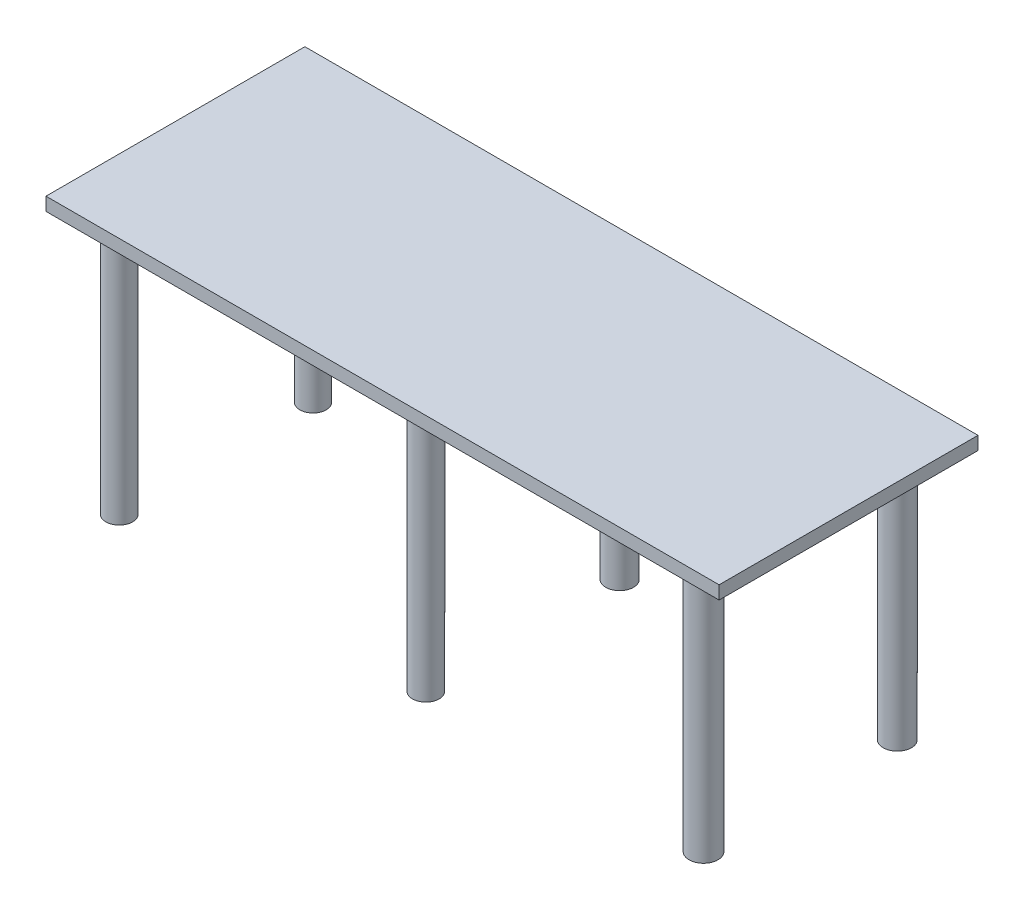
ISO-10303-21;
HEADER;
FILE_DESCRIPTION(('STEP AP214'),'2;1');
FILE_NAME('part.step','',(''),(''),'','','');
FILE_SCHEMA(('AUTOMOTIVE_DESIGN { 1 0 10303 214 1 1 1 1 }'));
ENDSEC;
DATA;
#1=APPLICATION_CONTEXT('core data for automotive mechanical design processes');
#2=APPLICATION_PROTOCOL_DEFINITION('international standard','automotive_design',2000,#1);
#3=PRODUCT_CONTEXT('',#1,'mechanical');
#4=PRODUCT('Part','Part','',(#3));
#5=PRODUCT_RELATED_PRODUCT_CATEGORY('part','',(#4));
#6=PRODUCT_DEFINITION_FORMATION('','',#4);
#7=PRODUCT_DEFINITION_CONTEXT('part definition',#1,'design');
#8=PRODUCT_DEFINITION('design','',#6,#7);
#9=PRODUCT_DEFINITION_SHAPE('','',#8);
#10=(LENGTH_UNIT() NAMED_UNIT(*) SI_UNIT(.MILLI.,.METRE.));
#11=(NAMED_UNIT(*) PLANE_ANGLE_UNIT() SI_UNIT($,.RADIAN.));
#12=(NAMED_UNIT(*) SI_UNIT($,.STERADIAN.) SOLID_ANGLE_UNIT());
#13=UNCERTAINTY_MEASURE_WITH_UNIT(LENGTH_MEASURE(1.E-05),#10,'distance_accuracy_value','');
#14=(GEOMETRIC_REPRESENTATION_CONTEXT(3) GLOBAL_UNCERTAINTY_ASSIGNED_CONTEXT((#13)) GLOBAL_UNIT_ASSIGNED_CONTEXT((#10,
#11,#12)) REPRESENTATION_CONTEXT('',''));
#15=CARTESIAN_POINT('',(0.,0.,0.));
#16=DIRECTION('',(0.,0.,1.));
#17=DIRECTION('',(1.,0.,0.));
#18=AXIS2_PLACEMENT_3D('',#15,#16,#17);
#19=CARTESIAN_POINT('',(-683.200611325611,149.732142857143,500.));
#20=DIRECTION('',(1.,0.,0.));
#21=DIRECTION('',(0.,0.,-1.));
#22=AXIS2_PLACEMENT_3D('',#19,#20,#21);
#23=PLANE('',#22);
#24=DIRECTION('',(0.,-1.,0.));
#25=VECTOR('',#24,1.);
#26=CARTESIAN_POINT('',(-683.200611325611,149.732142857143,0.));
#27=LINE('',#26,#25);
#28=CARTESIAN_POINT('',(-683.200611325611,149.732142857143,0.));
#29=VERTEX_POINT('',#28);
#30=CARTESIAN_POINT('',(-683.200611325611,124.196428571429,0.));
#31=VERTEX_POINT('',#30);
#32=EDGE_CURVE('E100',#29,#31,#27,.T.);
#33=ORIENTED_EDGE('',*,*,#32,.T.);
#34=DIRECTION('',(0.,0.,-1.));
#35=VECTOR('',#34,1.);
#36=CARTESIAN_POINT('',(-683.200611325611,124.196428571429,500.));
#37=LINE('',#36,#35);
#38=CARTESIAN_POINT('',(-683.200611325611,124.196428571429,500.));
#39=VERTEX_POINT('',#38);
#40=EDGE_CURVE('E91',#39,#31,#37,.T.);
#41=ORIENTED_EDGE('',*,*,#40,.F.);
#42=DIRECTION('',(0.,-1.,0.));
#43=VECTOR('',#42,1.);
#44=CARTESIAN_POINT('',(-683.200611325611,149.732142857143,500.));
#45=LINE('',#44,#43);
#46=CARTESIAN_POINT('',(-683.200611325611,149.732142857143,500.));
#47=VERTEX_POINT('',#46);
#48=EDGE_CURVE('E85',#47,#39,#45,.T.);
#49=ORIENTED_EDGE('',*,*,#48,.F.);
#50=DIRECTION('',(0.,0.,-1.));
#51=VECTOR('',#50,1.);
#52=CARTESIAN_POINT('',(-683.200611325611,149.732142857143,500.));
#53=LINE('',#52,#51);
#54=EDGE_CURVE('E96',#47,#29,#53,.T.);
#55=ORIENTED_EDGE('',*,*,#54,.T.);
#56=EDGE_LOOP('',(#33,#41,#49,#55));
#57=FACE_BOUND('',#56,.T.);
#58=ADVANCED_FACE('F33',(#57),#23,.F.);
#59=CARTESIAN_POINT('',(-683.200611325611,124.196428571429,500.));
#60=DIRECTION('',(0.,1.,0.));
#61=DIRECTION('',(0.,0.,1.));
#62=AXIS2_PLACEMENT_3D('',#59,#60,#61);
#63=PLANE('',#62);
#64=CARTESIAN_POINT('',(522.438513891831,124.196428571429,61.4411742810487));
#65=DIRECTION('',(0.,1.,0.));
#66=DIRECTION('',(0.,0.,1.));
#67=AXIS2_PLACEMENT_3D('',#64,#65,#66);
#68=CIRCLE('',#67,27.2442409784036);
#69=CARTESIAN_POINT('',(522.438513891831,124.196428571429,88.6854152594522));
#70=VERTEX_POINT('',#69);
#71=EDGE_CURVE('E11',#70,#70,#68,.F.);
#72=ORIENTED_EDGE('',*,*,#71,.F.);
#73=EDGE_LOOP('',(#72));
#74=FACE_BOUND('',#73,.T.);
#75=CARTESIAN_POINT('',(-13.8428611567456,124.196428571429,61.4411742810487));
#76=DIRECTION('',(0.,1.,0.));
#77=DIRECTION('',(0.,0.,1.));
#78=AXIS2_PLACEMENT_3D('',#75,#76,#77);
#79=CIRCLE('',#78,26.7952228981362);
#80=CARTESIAN_POINT('',(-13.8428611567456,124.196428571429,88.2363971791849));
#81=VERTEX_POINT('',#80);
#82=EDGE_CURVE('E41',#81,#81,#79,.F.);
#83=ORIENTED_EDGE('',*,*,#82,.F.);
#84=EDGE_LOOP('',(#83));
#85=FACE_BOUND('',#84,.T.);
#86=CARTESIAN_POINT('',(522.438513891831,124.196428571429,435.69101087912));
#87=DIRECTION('',(0.,1.,0.));
#88=DIRECTION('',(0.,0.,1.));
#89=AXIS2_PLACEMENT_3D('',#86,#87,#88);
#90=CIRCLE('',#89,27.8414459809754);
#91=CARTESIAN_POINT('',(522.438513891831,124.196428571429,463.532456860095));
#92=VERTEX_POINT('',#91);
#93=EDGE_CURVE('E119',#92,#92,#90,.F.);
#94=ORIENTED_EDGE('',*,*,#93,.F.);
#95=EDGE_LOOP('',(#94));
#96=FACE_BOUND('',#95,.T.);
#97=CARTESIAN_POINT('',(-13.8428611567456,124.196428571429,435.69101087912));
#98=DIRECTION('',(0.,1.,0.));
#99=DIRECTION('',(0.,0.,1.));
#100=AXIS2_PLACEMENT_3D('',#97,#98,#99);
#101=CIRCLE('',#100,25.8103335584877);
#102=CARTESIAN_POINT('',(-13.8428611567456,124.196428571429,461.501344437607));
#103=VERTEX_POINT('',#102);
#104=EDGE_CURVE('E116',#103,#103,#101,.F.);
#105=ORIENTED_EDGE('',*,*,#104,.F.);
#106=EDGE_LOOP('',(#105));
#107=FACE_BOUND('',#106,.T.);
#108=CARTESIAN_POINT('',(-606.046625582046,124.196428571429,61.4411742810487));
#109=DIRECTION('',(0.,1.,0.));
#110=DIRECTION('',(0.,0.,1.));
#111=AXIS2_PLACEMENT_3D('',#108,#109,#110);
#112=CIRCLE('',#111,25.3684119136891);
#113=CARTESIAN_POINT('',(-606.046625582046,124.196428571429,86.8095861947377));
#114=VERTEX_POINT('',#113);
#115=EDGE_CURVE('E113',#114,#114,#112,.F.);
#116=ORIENTED_EDGE('',*,*,#115,.F.);
#117=EDGE_LOOP('',(#116));
#118=FACE_BOUND('',#117,.T.);
#119=CARTESIAN_POINT('',(-606.046625582046,124.196428571429,435.69101087912));
#120=DIRECTION('',(0.,1.,0.));
#121=DIRECTION('',(0.,0.,1.));
#122=AXIS2_PLACEMENT_3D('',#119,#120,#121);
#123=CIRCLE('',#122,25.8103335584877);
#124=CARTESIAN_POINT('',(-606.046625582046,124.196428571429,461.501344437607));
#125=VERTEX_POINT('',#124);
#126=EDGE_CURVE('E110',#125,#125,#123,.F.);
#127=ORIENTED_EDGE('',*,*,#126,.F.);
#128=EDGE_LOOP('',(#127));
#129=FACE_BOUND('',#128,.T.);
#130=DIRECTION('',(1.,0.,0.));
#131=VECTOR('',#130,1.);
#132=CARTESIAN_POINT('',(-683.200611325611,124.196428571429,0.));
#133=LINE('',#132,#131);
#134=CARTESIAN_POINT('',(616.799388674389,124.196428571429,0.));
#135=VERTEX_POINT('',#134);
#136=EDGE_CURVE('E90',#31,#135,#133,.T.);
#137=ORIENTED_EDGE('',*,*,#136,.T.);
#138=DIRECTION('',(0.,0.,-1.));
#139=VECTOR('',#138,1.);
#140=CARTESIAN_POINT('',(616.799388674389,124.196428571429,500.));
#141=LINE('',#140,#139);
#142=CARTESIAN_POINT('',(616.799388674389,124.196428571429,500.));
#143=VERTEX_POINT('',#142);
#144=EDGE_CURVE('E88',#143,#135,#141,.T.);
#145=ORIENTED_EDGE('',*,*,#144,.F.);
#146=DIRECTION('',(1.,0.,0.));
#147=VECTOR('',#146,1.);
#148=CARTESIAN_POINT('',(-683.200611325611,124.196428571429,500.));
#149=LINE('',#148,#147);
#150=EDGE_CURVE('E80',#39,#143,#149,.T.);
#151=ORIENTED_EDGE('',*,*,#150,.F.);
#152=ORIENTED_EDGE('',*,*,#40,.T.);
#153=EDGE_LOOP('',(#137,#145,#151,#152));
#154=FACE_BOUND('',#153,.T.);
#155=ADVANCED_FACE('F89',(#74,#85,#96,#107,#118,#129,#154),#63,.F.);
#156=CARTESIAN_POINT('',(616.799388674389,149.732142857143,500.));
#157=DIRECTION('',(-1.,0.,0.));
#158=DIRECTION('',(0.,0.,1.));
#159=AXIS2_PLACEMENT_3D('',#156,#157,#158);
#160=PLANE('',#159);
#161=DIRECTION('',(0.,1.,0.));
#162=VECTOR('',#161,1.);
#163=CARTESIAN_POINT('',(616.799388674389,149.732142857143,0.));
#164=LINE('',#163,#162);
#165=CARTESIAN_POINT('',(616.799388674389,149.732142857143,0.));
#166=VERTEX_POINT('',#165);
#167=EDGE_CURVE('E66',#135,#166,#164,.T.);
#168=ORIENTED_EDGE('',*,*,#167,.T.);
#169=DIRECTION('',(0.,0.,-1.));
#170=VECTOR('',#169,1.);
#171=CARTESIAN_POINT('',(616.799388674389,149.732142857143,500.));
#172=LINE('',#171,#170);
#173=CARTESIAN_POINT('',(616.799388674389,149.732142857143,500.));
#174=VERTEX_POINT('',#173);
#175=EDGE_CURVE('E92',#174,#166,#172,.T.);
#176=ORIENTED_EDGE('',*,*,#175,.F.);
#177=DIRECTION('',(0.,1.,0.));
#178=VECTOR('',#177,1.);
#179=CARTESIAN_POINT('',(616.799388674389,149.732142857143,500.));
#180=LINE('',#179,#178);
#181=EDGE_CURVE('E83',#143,#174,#180,.T.);
#182=ORIENTED_EDGE('',*,*,#181,.F.);
#183=ORIENTED_EDGE('',*,*,#144,.T.);
#184=EDGE_LOOP('',(#168,#176,#182,#183));
#185=FACE_BOUND('',#184,.T.);
#186=ADVANCED_FACE('F94',(#185),#160,.F.);
#187=CARTESIAN_POINT('',(-683.200611325611,149.732142857143,500.));
#188=DIRECTION('',(0.,-1.,0.));
#189=DIRECTION('',(0.,0.,-1.));
#190=AXIS2_PLACEMENT_3D('',#187,#188,#189);
#191=PLANE('',#190);
#192=DIRECTION('',(-1.,0.,0.));
#193=VECTOR('',#192,1.);
#194=CARTESIAN_POINT('',(-683.200611325611,149.732142857143,0.));
#195=LINE('',#194,#193);
#196=EDGE_CURVE('E72',#166,#29,#195,.T.);
#197=ORIENTED_EDGE('',*,*,#196,.T.);
#198=ORIENTED_EDGE('',*,*,#54,.F.);
#199=DIRECTION('',(-1.,0.,0.));
#200=VECTOR('',#199,1.);
#201=CARTESIAN_POINT('',(-683.200611325611,149.732142857143,500.));
#202=LINE('',#201,#200);
#203=EDGE_CURVE('E49',#174,#47,#202,.T.);
#204=ORIENTED_EDGE('',*,*,#203,.F.);
#205=ORIENTED_EDGE('',*,*,#175,.T.);
#206=EDGE_LOOP('',(#197,#198,#204,#205));
#207=FACE_BOUND('',#206,.T.);
#208=ADVANCED_FACE('F159',(#207),#191,.F.);
#209=CARTESIAN_POINT('',(0.,0.,500.));
#210=DIRECTION('',(0.,0.,1.));
#211=DIRECTION('',(1.,0.,0.));
#212=AXIS2_PLACEMENT_3D('',#209,#210,#211);
#213=PLANE('',#212);
#214=ORIENTED_EDGE('',*,*,#48,.T.);
#215=ORIENTED_EDGE('',*,*,#150,.T.);
#216=ORIENTED_EDGE('',*,*,#181,.T.);
#217=ORIENTED_EDGE('',*,*,#203,.T.);
#218=EDGE_LOOP('',(#214,#215,#216,#217));
#219=FACE_BOUND('',#218,.T.);
#220=ADVANCED_FACE('F81',(#219),#213,.T.);
#221=CARTESIAN_POINT('',(0.,0.,0.));
#222=DIRECTION('',(0.,0.,1.));
#223=DIRECTION('',(1.,0.,0.));
#224=AXIS2_PLACEMENT_3D('',#221,#222,#223);
#225=PLANE('',#224);
#226=ORIENTED_EDGE('',*,*,#32,.F.);
#227=ORIENTED_EDGE('',*,*,#196,.F.);
#228=ORIENTED_EDGE('',*,*,#167,.F.);
#229=ORIENTED_EDGE('',*,*,#136,.F.);
#230=EDGE_LOOP('',(#226,#227,#228,#229));
#231=FACE_BOUND('',#230,.T.);
#232=ADVANCED_FACE('F140',(#231),#225,.F.);
#233=CARTESIAN_POINT('',(-606.046625582046,-375.803571428571,435.69101087912));
#234=DIRECTION('',(0.,1.,0.));
#235=DIRECTION('',(0.,0.,1.));
#236=AXIS2_PLACEMENT_3D('',#233,#234,#235);
#237=CYLINDRICAL_SURFACE('',#236,25.8103335584877);
#238=CARTESIAN_POINT('',(-606.046625582046,-375.803571428571,435.69101087912));
#239=DIRECTION('',(0.,-1.,0.));
#240=DIRECTION('',(0.,0.,-1.));
#241=AXIS2_PLACEMENT_3D('',#238,#239,#240);
#242=CIRCLE('',#241,25.8103335584877);
#243=CARTESIAN_POINT('',(-606.046625582046,-375.803571428571,409.880677320632));
#244=VERTEX_POINT('',#243);
#245=EDGE_CURVE('E103',#244,#244,#242,.T.);
#246=ORIENTED_EDGE('',*,*,#245,.F.);
#247=EDGE_LOOP('',(#246));
#248=FACE_BOUND('',#247,.T.);
#249=ORIENTED_EDGE('',*,*,#126,.T.);
#250=EDGE_LOOP('',(#249));
#251=FACE_BOUND('',#250,.T.);
#252=ADVANCED_FACE('F137',(#248,#251),#237,.T.);
#253=CARTESIAN_POINT('',(-606.046625582046,-375.803571428571,435.69101087912));
#254=DIRECTION('',(0.,-1.,0.));
#255=DIRECTION('',(0.,0.,-1.));
#256=AXIS2_PLACEMENT_3D('',#253,#254,#255);
#257=PLANE('',#256);
#258=ORIENTED_EDGE('',*,*,#245,.T.);
#259=EDGE_LOOP('',(#258));
#260=FACE_BOUND('',#259,.T.);
#261=ADVANCED_FACE('F139',(#260),#257,.T.);
#262=CARTESIAN_POINT('',(-606.046625582046,-375.803571428571,61.4411742810487));
#263=DIRECTION('',(0.,1.,0.));
#264=DIRECTION('',(0.,0.,1.));
#265=AXIS2_PLACEMENT_3D('',#262,#263,#264);
#266=CYLINDRICAL_SURFACE('',#265,25.3684119136891);
#267=CARTESIAN_POINT('',(-606.046625582046,-375.803571428571,61.4411742810487));
#268=DIRECTION('',(0.,-1.,0.));
#269=DIRECTION('',(0.,0.,-1.));
#270=AXIS2_PLACEMENT_3D('',#267,#268,#269);
#271=CIRCLE('',#270,25.3684119136891);
#272=CARTESIAN_POINT('',(-606.046625582046,-375.803571428571,36.0727623673596));
#273=VERTEX_POINT('',#272);
#274=EDGE_CURVE('E304',#273,#273,#271,.T.);
#275=ORIENTED_EDGE('',*,*,#274,.F.);
#276=EDGE_LOOP('',(#275));
#277=FACE_BOUND('',#276,.T.);
#278=ORIENTED_EDGE('',*,*,#115,.T.);
#279=EDGE_LOOP('',(#278));
#280=FACE_BOUND('',#279,.T.);
#281=ADVANCED_FACE('F147',(#277,#280),#266,.T.);
#282=CARTESIAN_POINT('',(-606.046625582046,-375.803571428571,61.4411742810487));
#283=DIRECTION('',(0.,-1.,0.));
#284=DIRECTION('',(0.,0.,-1.));
#285=AXIS2_PLACEMENT_3D('',#282,#283,#284);
#286=PLANE('',#285);
#287=ORIENTED_EDGE('',*,*,#274,.T.);
#288=EDGE_LOOP('',(#287));
#289=FACE_BOUND('',#288,.T.);
#290=ADVANCED_FACE('F197',(#289),#286,.T.);
#291=CARTESIAN_POINT('',(-13.8428611567456,-375.803571428571,435.69101087912));
#292=DIRECTION('',(0.,1.,0.));
#293=DIRECTION('',(0.,0.,1.));
#294=AXIS2_PLACEMENT_3D('',#291,#292,#293);
#295=CYLINDRICAL_SURFACE('',#294,25.8103335584877);
#296=CARTESIAN_POINT('',(-13.8428611567456,-375.803571428571,435.69101087912));
#297=DIRECTION('',(0.,-1.,0.));
#298=DIRECTION('',(0.,0.,-1.));
#299=AXIS2_PLACEMENT_3D('',#296,#297,#298);
#300=CIRCLE('',#299,25.8103335584877);
#301=CARTESIAN_POINT('',(-13.8428611567456,-375.803571428571,409.880677320632));
#302=VERTEX_POINT('',#301);
#303=EDGE_CURVE('E301',#302,#302,#300,.T.);
#304=ORIENTED_EDGE('',*,*,#303,.F.);
#305=EDGE_LOOP('',(#304));
#306=FACE_BOUND('',#305,.T.);
#307=ORIENTED_EDGE('',*,*,#104,.T.);
#308=EDGE_LOOP('',(#307));
#309=FACE_BOUND('',#308,.T.);
#310=ADVANCED_FACE('F207',(#306,#309),#295,.T.);
#311=CARTESIAN_POINT('',(-13.8428611567456,-375.803571428571,435.69101087912));
#312=DIRECTION('',(0.,-1.,0.));
#313=DIRECTION('',(0.,0.,-1.));
#314=AXIS2_PLACEMENT_3D('',#311,#312,#313);
#315=PLANE('',#314);
#316=ORIENTED_EDGE('',*,*,#303,.T.);
#317=EDGE_LOOP('',(#316));
#318=FACE_BOUND('',#317,.T.);
#319=ADVANCED_FACE('F217',(#318),#315,.T.);
#320=CARTESIAN_POINT('',(522.438513891831,-375.803571428571,435.69101087912));
#321=DIRECTION('',(0.,1.,0.));
#322=DIRECTION('',(0.,0.,1.));
#323=AXIS2_PLACEMENT_3D('',#320,#321,#322);
#324=CYLINDRICAL_SURFACE('',#323,27.8414459809754);
#325=CARTESIAN_POINT('',(522.438513891831,-375.803571428571,435.69101087912));
#326=DIRECTION('',(0.,-1.,0.));
#327=DIRECTION('',(0.,0.,-1.));
#328=AXIS2_PLACEMENT_3D('',#325,#326,#327);
#329=CIRCLE('',#328,27.8414459809754);
#330=CARTESIAN_POINT('',(522.438513891831,-375.803571428571,407.849564898144));
#331=VERTEX_POINT('',#330);
#332=EDGE_CURVE('E296',#331,#331,#329,.T.);
#333=ORIENTED_EDGE('',*,*,#332,.F.);
#334=EDGE_LOOP('',(#333));
#335=FACE_BOUND('',#334,.T.);
#336=ORIENTED_EDGE('',*,*,#93,.T.);
#337=EDGE_LOOP('',(#336));
#338=FACE_BOUND('',#337,.T.);
#339=ADVANCED_FACE('F227',(#335,#338),#324,.T.);
#340=CARTESIAN_POINT('',(522.438513891831,-375.803571428571,435.69101087912));
#341=DIRECTION('',(0.,-1.,0.));
#342=DIRECTION('',(0.,0.,-1.));
#343=AXIS2_PLACEMENT_3D('',#340,#341,#342);
#344=PLANE('',#343);
#345=ORIENTED_EDGE('',*,*,#332,.T.);
#346=EDGE_LOOP('',(#345));
#347=FACE_BOUND('',#346,.T.);
#348=ADVANCED_FACE('F237',(#347),#344,.T.);
#349=CARTESIAN_POINT('',(-13.8428611567456,-375.803571428571,61.4411742810487));
#350=DIRECTION('',(0.,1.,0.));
#351=DIRECTION('',(0.,0.,1.));
#352=AXIS2_PLACEMENT_3D('',#349,#350,#351);
#353=CYLINDRICAL_SURFACE('',#352,26.7952228981362);
#354=CARTESIAN_POINT('',(-13.8428611567456,-375.803571428571,61.4411742810487));
#355=DIRECTION('',(0.,-1.,0.));
#356=DIRECTION('',(0.,0.,-1.));
#357=AXIS2_PLACEMENT_3D('',#354,#355,#356);
#358=CIRCLE('',#357,26.7952228981362);
#359=CARTESIAN_POINT('',(-13.8428611567456,-375.803571428571,34.6459513829124));
#360=VERTEX_POINT('',#359);
#361=EDGE_CURVE('E293',#360,#360,#358,.T.);
#362=ORIENTED_EDGE('',*,*,#361,.F.);
#363=EDGE_LOOP('',(#362));
#364=FACE_BOUND('',#363,.T.);
#365=ORIENTED_EDGE('',*,*,#82,.T.);
#366=EDGE_LOOP('',(#365));
#367=FACE_BOUND('',#366,.T.);
#368=ADVANCED_FACE('F124',(#364,#367),#353,.T.);
#369=CARTESIAN_POINT('',(-13.8428611567456,-375.803571428571,61.4411742810487));
#370=DIRECTION('',(0.,-1.,0.));
#371=DIRECTION('',(0.,0.,-1.));
#372=AXIS2_PLACEMENT_3D('',#369,#370,#371);
#373=PLANE('',#372);
#374=ORIENTED_EDGE('',*,*,#361,.T.);
#375=EDGE_LOOP('',(#374));
#376=FACE_BOUND('',#375,.T.);
#377=ADVANCED_FACE('F256',(#376),#373,.T.);
#378=CARTESIAN_POINT('',(522.438513891831,-375.803571428571,61.4411742810487));
#379=DIRECTION('',(0.,1.,0.));
#380=DIRECTION('',(0.,0.,1.));
#381=AXIS2_PLACEMENT_3D('',#378,#379,#380);
#382=CYLINDRICAL_SURFACE('',#381,27.2442409784036);
#383=CARTESIAN_POINT('',(522.438513891831,-375.803571428571,61.4411742810487));
#384=DIRECTION('',(0.,-1.,0.));
#385=DIRECTION('',(0.,0.,-1.));
#386=AXIS2_PLACEMENT_3D('',#383,#384,#385);
#387=CIRCLE('',#386,27.2442409784036);
#388=CARTESIAN_POINT('',(522.438513891831,-375.803571428571,34.1969333026451));
#389=VERTEX_POINT('',#388);
#390=EDGE_CURVE('E292',#389,#389,#387,.T.);
#391=ORIENTED_EDGE('',*,*,#390,.F.);
#392=EDGE_LOOP('',(#391));
#393=FACE_BOUND('',#392,.T.);
#394=ORIENTED_EDGE('',*,*,#71,.T.);
#395=EDGE_LOOP('',(#394));
#396=FACE_BOUND('',#395,.T.);
#397=ADVANCED_FACE('F266',(#393,#396),#382,.T.);
#398=CARTESIAN_POINT('',(522.438513891831,-375.803571428571,61.4411742810487));
#399=DIRECTION('',(0.,-1.,0.));
#400=DIRECTION('',(0.,0.,-1.));
#401=AXIS2_PLACEMENT_3D('',#398,#399,#400);
#402=PLANE('',#401);
#403=ORIENTED_EDGE('',*,*,#390,.T.);
#404=EDGE_LOOP('',(#403));
#405=FACE_BOUND('',#404,.T.);
#406=ADVANCED_FACE('F276',(#405),#402,.T.);
#407=CLOSED_SHELL('',(#58,#155,#186,#208,#220,#232,#252,#261,#281,#290,#310,#319,#339,#348,#368,
#377,#397,#406));
#408=MANIFOLD_SOLID_BREP('B2',#407);
#409=ADVANCED_BREP_SHAPE_REPRESENTATION('',(#18,#408),#14);
#410=SHAPE_DEFINITION_REPRESENTATION(#9,#409);
ENDSEC;
END-ISO-10303-21;
